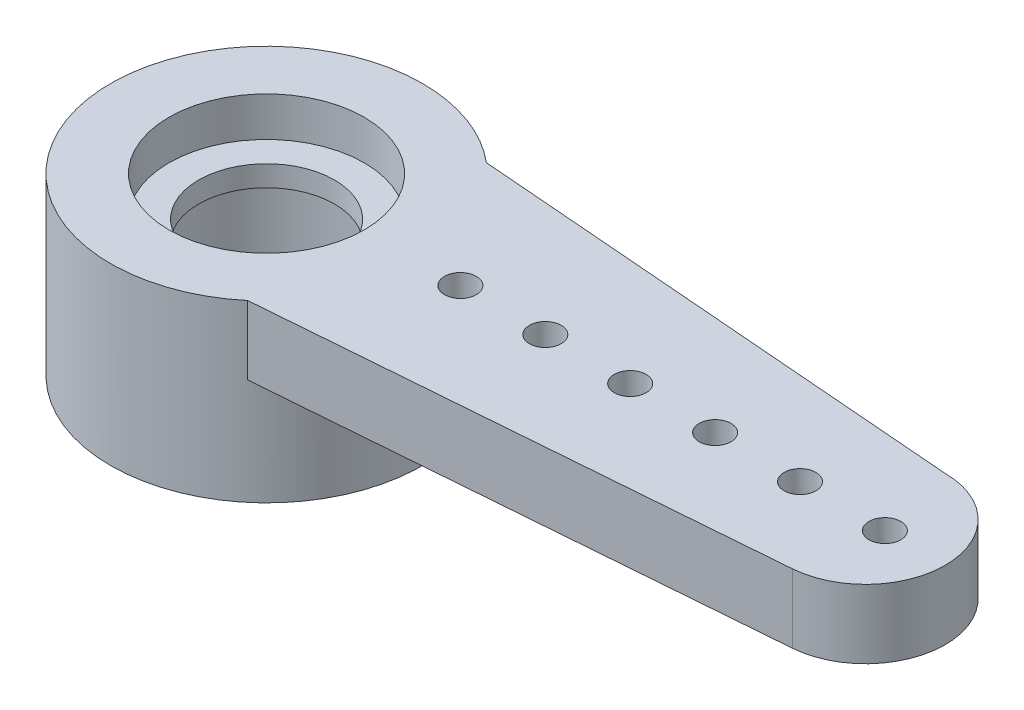
ISO-10303-21;
HEADER;
FILE_DESCRIPTION(('STEP AP214'),'2;1');
FILE_NAME('part.step','',(''),(''),'','','');
FILE_SCHEMA(('AUTOMOTIVE_DESIGN { 1 0 10303 214 1 1 1 1 }'));
ENDSEC;
DATA;
#1=APPLICATION_CONTEXT('core data for automotive mechanical design processes');
#2=APPLICATION_PROTOCOL_DEFINITION('international standard','automotive_design',2000,#1);
#3=PRODUCT_CONTEXT('',#1,'mechanical');
#4=PRODUCT('Part','Part','',(#3));
#5=PRODUCT_RELATED_PRODUCT_CATEGORY('part','',(#4));
#6=PRODUCT_DEFINITION_FORMATION('','',#4);
#7=PRODUCT_DEFINITION_CONTEXT('part definition',#1,'design');
#8=PRODUCT_DEFINITION('design','',#6,#7);
#9=PRODUCT_DEFINITION_SHAPE('','',#8);
#10=(LENGTH_UNIT() NAMED_UNIT(*) SI_UNIT(.MILLI.,.METRE.));
#11=(NAMED_UNIT(*) PLANE_ANGLE_UNIT() SI_UNIT($,.RADIAN.));
#12=(NAMED_UNIT(*) SI_UNIT($,.STERADIAN.) SOLID_ANGLE_UNIT());
#13=UNCERTAINTY_MEASURE_WITH_UNIT(LENGTH_MEASURE(1.E-05),#10,'distance_accuracy_value','');
#14=(GEOMETRIC_REPRESENTATION_CONTEXT(3) GLOBAL_UNCERTAINTY_ASSIGNED_CONTEXT((#13)) GLOBAL_UNIT_ASSIGNED_CONTEXT((#10,
#11,#12)) REPRESENTATION_CONTEXT('',''));
#15=CARTESIAN_POINT('',(0.,0.,0.));
#16=DIRECTION('',(0.,0.,1.));
#17=DIRECTION('',(1.,0.,0.));
#18=AXIS2_PLACEMENT_3D('',#15,#16,#17);
#19=CARTESIAN_POINT('',(-32.4125946346762,6.1454833995939,-10.0097718724736));
#20=DIRECTION('',(0.,-1.,0.));
#21=DIRECTION('',(0.,0.,-1.));
#22=AXIS2_PLACEMENT_3D('',#19,#20,#21);
#23=CYLINDRICAL_SURFACE('',#22,1.6);
#24=CARTESIAN_POINT('',(-32.4125946346762,0.200000000000001,-10.0097718724736));
#25=DIRECTION('',(0.,-1.,0.));
#26=DIRECTION('',(0.,0.,-1.));
#27=AXIS2_PLACEMENT_3D('',#24,#25,#26);
#28=CIRCLE('',#27,1.6);
#29=CARTESIAN_POINT('',(-32.4125946346762,0.200000000000001,-11.6097718724735));
#30=VERTEX_POINT('',#29);
#31=EDGE_CURVE('E199',#30,#30,#28,.T.);
#32=ORIENTED_EDGE('',*,*,#31,.T.);
#33=EDGE_LOOP('',(#32));
#34=FACE_BOUND('',#33,.T.);
#35=CARTESIAN_POINT('',(-32.4125946346762,0.69,-10.0097718724736));
#36=DIRECTION('',(0.,1.,0.));
#37=DIRECTION('',(0.,0.,1.));
#38=AXIS2_PLACEMENT_3D('',#35,#36,#37);
#39=CIRCLE('',#38,1.6);
#40=CARTESIAN_POINT('',(-32.4125946346762,0.69,-8.40977187247356));
#41=VERTEX_POINT('',#40);
#42=EDGE_CURVE('E37',#41,#41,#39,.F.);
#43=ORIENTED_EDGE('',*,*,#42,.F.);
#44=EDGE_LOOP('',(#43));
#45=FACE_BOUND('',#44,.T.);
#46=ADVANCED_FACE('F33',(#34,#45),#23,.F.);
#47=CARTESIAN_POINT('',(-32.4125946346762,0.,-10.0097718724736));
#48=DIRECTION('',(0.,1.,0.));
#49=DIRECTION('',(0.,0.,1.));
#50=AXIS2_PLACEMENT_3D('',#47,#48,#49);
#51=PLANE('',#50);
#52=CARTESIAN_POINT('',(-17.8462780893284,0.,-10.0089973818618));
#53=DIRECTION('',(0.,-1.,0.));
#54=DIRECTION('',(0.,0.,-1.));
#55=AXIS2_PLACEMENT_3D('',#52,#53,#54);
#56=CIRCLE('',#55,0.374999999999999);
#57=CARTESIAN_POINT('',(-17.8462780893284,0.,-10.3839973818618));
#58=VERTEX_POINT('',#57);
#59=EDGE_CURVE('E339',#58,#58,#56,.T.);
#60=ORIENTED_EDGE('',*,*,#59,.F.);
#61=EDGE_LOOP('',(#60));
#62=FACE_BOUND('',#61,.T.);
#63=CARTESIAN_POINT('',(-19.8462780893284,0.,-10.0089973818618));
#64=DIRECTION('',(0.,-1.,0.));
#65=DIRECTION('',(0.,0.,-1.));
#66=AXIS2_PLACEMENT_3D('',#63,#64,#65);
#67=CIRCLE('',#66,0.374999999999999);
#68=CARTESIAN_POINT('',(-19.8462780893284,0.,-10.3839973818618));
#69=VERTEX_POINT('',#68);
#70=EDGE_CURVE('E340',#69,#69,#67,.T.);
#71=ORIENTED_EDGE('',*,*,#70,.F.);
#72=EDGE_LOOP('',(#71));
#73=FACE_BOUND('',#72,.T.);
#74=CARTESIAN_POINT('',(-21.8462780893284,0.,-10.0089973818618));
#75=DIRECTION('',(0.,-1.,0.));
#76=DIRECTION('',(0.,0.,-1.));
#77=AXIS2_PLACEMENT_3D('',#74,#75,#76);
#78=CIRCLE('',#77,0.374999999999999);
#79=CARTESIAN_POINT('',(-21.8462780893284,0.,-10.3839973818618));
#80=VERTEX_POINT('',#79);
#81=EDGE_CURVE('E347',#80,#80,#78,.T.);
#82=ORIENTED_EDGE('',*,*,#81,.F.);
#83=EDGE_LOOP('',(#82));
#84=FACE_BOUND('',#83,.T.);
#85=CARTESIAN_POINT('',(-23.8462780893284,0.,-10.0089973818618));
#86=DIRECTION('',(0.,-1.,0.));
#87=DIRECTION('',(0.,0.,-1.));
#88=AXIS2_PLACEMENT_3D('',#85,#86,#87);
#89=CIRCLE('',#88,0.374999999999999);
#90=CARTESIAN_POINT('',(-23.8462780893284,0.,-10.3839973818618));
#91=VERTEX_POINT('',#90);
#92=EDGE_CURVE('E351',#91,#91,#89,.T.);
#93=ORIENTED_EDGE('',*,*,#92,.F.);
#94=EDGE_LOOP('',(#93));
#95=FACE_BOUND('',#94,.T.);
#96=CARTESIAN_POINT('',(-27.8462780893284,0.,-10.0089973818618));
#97=DIRECTION('',(0.,-1.,0.));
#98=DIRECTION('',(0.,0.,-1.));
#99=AXIS2_PLACEMENT_3D('',#96,#97,#98);
#100=CIRCLE('',#99,0.374999999999999);
#101=CARTESIAN_POINT('',(-27.8462780893284,0.,-10.3839973818618));
#102=VERTEX_POINT('',#101);
#103=EDGE_CURVE('E355',#102,#102,#100,.T.);
#104=ORIENTED_EDGE('',*,*,#103,.F.);
#105=EDGE_LOOP('',(#104));
#106=FACE_BOUND('',#105,.T.);
#107=CARTESIAN_POINT('',(-25.8462780893284,0.,-10.0089973818618));
#108=DIRECTION('',(0.,-1.,0.));
#109=DIRECTION('',(0.,0.,-1.));
#110=AXIS2_PLACEMENT_3D('',#107,#108,#109);
#111=CIRCLE('',#110,0.374999999999999);
#112=CARTESIAN_POINT('',(-25.8462780893284,0.,-10.3839973818618));
#113=VERTEX_POINT('',#112);
#114=EDGE_CURVE('E196',#113,#113,#111,.T.);
#115=ORIENTED_EDGE('',*,*,#114,.F.);
#116=EDGE_LOOP('',(#115));
#117=FACE_BOUND('',#116,.T.);
#118=CARTESIAN_POINT('',(-32.4125946346762,0.,-10.0097718724736));
#119=DIRECTION('',(0.,-1.,0.));
#120=DIRECTION('',(0.,0.,-1.));
#121=AXIS2_PLACEMENT_3D('',#118,#119,#120);
#122=CIRCLE('',#121,3.675);
#123=CARTESIAN_POINT('',(-30.045675129903,0.,-12.8210557531807));
#124=VERTEX_POINT('',#123);
#125=CARTESIAN_POINT('',(-30.0469709782512,0.,-7.19739748129409));
#126=VERTEX_POINT('',#125);
#127=EDGE_CURVE('E83',#124,#126,#122,.T.);
#128=ORIENTED_EDGE('',*,*,#127,.F.);
#129=DIRECTION('',(-0.996836583112928,0.,-0.0794784660630979));
#130=VECTOR('',#129,1.);
#131=CARTESIAN_POINT('',(-30.045675129903,0.,-12.8210557531807));
#132=LINE('',#131,#130);
#133=CARTESIAN_POINT('',(-18.3025946346762,0.,-11.8847718723248));
#134=VERTEX_POINT('',#133);
#135=EDGE_CURVE('E86',#134,#124,#132,.T.);
#136=ORIENTED_EDGE('',*,*,#135,.F.);
#137=CARTESIAN_POINT('',(-18.3025946346762,0.,-10.0097718724736));
#138=DIRECTION('',(0.,1.,0.));
#139=DIRECTION('',(0.,0.,1.));
#140=AXIS2_PLACEMENT_3D('',#137,#138,#139);
#141=CIRCLE('',#140,1.87499999985126);
#142=CARTESIAN_POINT('',(-18.1543476098355,0.,-8.14064164184003));
#143=VERTEX_POINT('',#142);
#144=EDGE_CURVE('E73',#143,#134,#141,.T.);
#145=ORIENTED_EDGE('',*,*,#144,.F.);
#146=DIRECTION('',(0.996869455909996,0.,-0.0790650863131628));
#147=VECTOR('',#146,1.);
#148=CARTESIAN_POINT('',(-30.0469709782512,0.,-7.19739748129409));
#149=LINE('',#148,#147);
#150=EDGE_CURVE('E66',#126,#143,#149,.T.);
#151=ORIENTED_EDGE('',*,*,#150,.F.);
#152=EDGE_LOOP('',(#128,#136,#145,#151));
#153=FACE_BOUND('',#152,.T.);
#154=ADVANCED_FACE('F85',(#62,#73,#84,#95,#106,#117,#153),#51,.F.);
#155=CARTESIAN_POINT('',(-32.4125946346762,1.62,-10.0097718724736));
#156=DIRECTION('',(0.,-1.,0.));
#157=DIRECTION('',(0.,0.,-1.));
#158=AXIS2_PLACEMENT_3D('',#155,#156,#157);
#159=CYLINDRICAL_SURFACE('',#158,3.675);
#160=DIRECTION('',(0.,-1.,0.));
#161=VECTOR('',#160,1.);
#162=CARTESIAN_POINT('',(-30.045675129903,1.62,-12.8210557531807));
#163=LINE('',#162,#161);
#164=CARTESIAN_POINT('',(-30.045675129903,1.62,-12.8210557531807));
#165=VERTEX_POINT('',#164);
#166=EDGE_CURVE('E95',#165,#124,#163,.T.);
#167=ORIENTED_EDGE('',*,*,#166,.T.);
#168=ORIENTED_EDGE('',*,*,#127,.T.);
#169=DIRECTION('',(0.,-1.,0.));
#170=VECTOR('',#169,1.);
#171=CARTESIAN_POINT('',(-30.0469709782512,1.62,-7.19739748129409));
#172=LINE('',#171,#170);
#173=CARTESIAN_POINT('',(-30.0469709782512,1.62,-7.19739748129409));
#174=VERTEX_POINT('',#173);
#175=EDGE_CURVE('E11',#174,#126,#172,.T.);
#176=ORIENTED_EDGE('',*,*,#175,.F.);
#177=CARTESIAN_POINT('',(-32.4125946346762,1.62,-10.0097718724736));
#178=DIRECTION('',(0.,1.,0.));
#179=DIRECTION('',(0.,0.,1.));
#180=AXIS2_PLACEMENT_3D('',#177,#178,#179);
#181=CIRCLE('',#180,3.675);
#182=EDGE_CURVE('E98',#165,#174,#181,.T.);
#183=ORIENTED_EDGE('',*,*,#182,.F.);
#184=EDGE_LOOP('',(#167,#168,#176,#183));
#185=FACE_BOUND('',#184,.T.);
#186=CARTESIAN_POINT('',(-32.4125946346762,-2.5,-10.0097718724736));
#187=DIRECTION('',(0.,-1.,0.));
#188=DIRECTION('',(0.,0.,-1.));
#189=AXIS2_PLACEMENT_3D('',#186,#187,#188);
#190=CIRCLE('',#189,3.675);
#191=CARTESIAN_POINT('',(-32.4125946346762,-2.5,-13.6847718724736));
#192=VERTEX_POINT('',#191);
#193=EDGE_CURVE('E90',#192,#192,#190,.T.);
#194=ORIENTED_EDGE('',*,*,#193,.F.);
#195=EDGE_LOOP('',(#194));
#196=FACE_BOUND('',#195,.T.);
#197=ADVANCED_FACE('F35',(#185,#196),#159,.T.);
#198=CARTESIAN_POINT('',(-30.0469709782512,1.62,-7.19739748129409));
#199=DIRECTION('',(-0.0790650863131628,0.,-0.996869455909996));
#200=DIRECTION('',(-0.996869455909996,0.,0.0790650863131628));
#201=AXIS2_PLACEMENT_3D('',#198,#199,#200);
#202=PLANE('',#201);
#203=ORIENTED_EDGE('',*,*,#150,.T.);
#204=DIRECTION('',(0.,-1.,0.));
#205=VECTOR('',#204,1.);
#206=CARTESIAN_POINT('',(-18.1543476098355,1.62,-8.14064164184003));
#207=LINE('',#206,#205);
#208=CARTESIAN_POINT('',(-18.1543476098355,1.62,-8.14064164184003));
#209=VERTEX_POINT('',#208);
#210=EDGE_CURVE('E43',#209,#143,#207,.T.);
#211=ORIENTED_EDGE('',*,*,#210,.F.);
#212=DIRECTION('',(0.996869455909996,0.,-0.0790650863131628));
#213=VECTOR('',#212,1.);
#214=CARTESIAN_POINT('',(-30.0469709782512,1.62,-7.19739748129409));
#215=LINE('',#214,#213);
#216=EDGE_CURVE('E78',#174,#209,#215,.T.);
#217=ORIENTED_EDGE('',*,*,#216,.F.);
#218=ORIENTED_EDGE('',*,*,#175,.T.);
#219=EDGE_LOOP('',(#203,#211,#217,#218));
#220=FACE_BOUND('',#219,.T.);
#221=ADVANCED_FACE('F126',(#220),#202,.F.);
#222=CARTESIAN_POINT('',(-18.3025946346762,1.62,-10.0097718724736));
#223=DIRECTION('',(0.,-1.,0.));
#224=DIRECTION('',(0.,0.,-1.));
#225=AXIS2_PLACEMENT_3D('',#222,#223,#224);
#226=CYLINDRICAL_SURFACE('',#225,1.87499999985126);
#227=ORIENTED_EDGE('',*,*,#144,.T.);
#228=DIRECTION('',(0.,-1.,0.));
#229=VECTOR('',#228,1.);
#230=CARTESIAN_POINT('',(-18.3025946346762,1.62,-11.8847718723248));
#231=LINE('',#230,#229);
#232=CARTESIAN_POINT('',(-18.3025946346762,1.62,-11.8847718723248));
#233=VERTEX_POINT('',#232);
#234=EDGE_CURVE('E97',#233,#134,#231,.T.);
#235=ORIENTED_EDGE('',*,*,#234,.F.);
#236=CARTESIAN_POINT('',(-18.3025946346762,1.62,-10.0097718724736));
#237=DIRECTION('',(0.,1.,0.));
#238=DIRECTION('',(0.,0.,1.));
#239=AXIS2_PLACEMENT_3D('',#236,#237,#238);
#240=CIRCLE('',#239,1.87499999985126);
#241=EDGE_CURVE('E103',#209,#233,#240,.T.);
#242=ORIENTED_EDGE('',*,*,#241,.F.);
#243=ORIENTED_EDGE('',*,*,#210,.T.);
#244=EDGE_LOOP('',(#227,#235,#242,#243));
#245=FACE_BOUND('',#244,.T.);
#246=ADVANCED_FACE('F124',(#245),#226,.T.);
#247=CARTESIAN_POINT('',(-30.045675129903,1.62,-12.8210557531807));
#248=DIRECTION('',(-0.0794784660630979,0.,0.996836583112928));
#249=DIRECTION('',(0.996836583112928,0.,0.0794784660630979));
#250=AXIS2_PLACEMENT_3D('',#247,#248,#249);
#251=PLANE('',#250);
#252=ORIENTED_EDGE('',*,*,#135,.T.);
#253=ORIENTED_EDGE('',*,*,#166,.F.);
#254=DIRECTION('',(-0.996836583112928,0.,-0.0794784660630979));
#255=VECTOR('',#254,1.);
#256=CARTESIAN_POINT('',(-30.045675129903,1.62,-12.8210557531807));
#257=LINE('',#256,#255);
#258=EDGE_CURVE('E52',#233,#165,#257,.T.);
#259=ORIENTED_EDGE('',*,*,#258,.F.);
#260=ORIENTED_EDGE('',*,*,#234,.T.);
#261=EDGE_LOOP('',(#252,#253,#259,#260));
#262=FACE_BOUND('',#261,.T.);
#263=ADVANCED_FACE('F94',(#262),#251,.F.);
#264=CARTESIAN_POINT('',(-32.4125946346762,1.62,-10.0097718724736));
#265=DIRECTION('',(0.,1.,0.));
#266=DIRECTION('',(0.,0.,1.));
#267=AXIS2_PLACEMENT_3D('',#264,#265,#266);
#268=PLANE('',#267);
#269=CARTESIAN_POINT('',(-17.8462780893284,1.62,-10.0089973818618));
#270=DIRECTION('',(0.,1.,0.));
#271=DIRECTION('',(0.,0.,1.));
#272=AXIS2_PLACEMENT_3D('',#269,#270,#271);
#273=CIRCLE('',#272,0.374999999999999);
#274=CARTESIAN_POINT('',(-17.8462780893284,1.62,-9.63399738186179));
#275=VERTEX_POINT('',#274);
#276=EDGE_CURVE('E167',#275,#275,#273,.F.);
#277=ORIENTED_EDGE('',*,*,#276,.T.);
#278=EDGE_LOOP('',(#277));
#279=FACE_BOUND('',#278,.T.);
#280=CARTESIAN_POINT('',(-19.8462780893284,1.62,-10.0089973818618));
#281=DIRECTION('',(0.,1.,0.));
#282=DIRECTION('',(0.,0.,1.));
#283=AXIS2_PLACEMENT_3D('',#280,#281,#282);
#284=CIRCLE('',#283,0.374999999999999);
#285=CARTESIAN_POINT('',(-19.8462780893284,1.62,-9.63399738186179));
#286=VERTEX_POINT('',#285);
#287=EDGE_CURVE('E171',#286,#286,#284,.F.);
#288=ORIENTED_EDGE('',*,*,#287,.T.);
#289=EDGE_LOOP('',(#288));
#290=FACE_BOUND('',#289,.T.);
#291=CARTESIAN_POINT('',(-21.8462780893284,1.62,-10.0089973818618));
#292=DIRECTION('',(0.,1.,0.));
#293=DIRECTION('',(0.,0.,1.));
#294=AXIS2_PLACEMENT_3D('',#291,#292,#293);
#295=CIRCLE('',#294,0.374999999999999);
#296=CARTESIAN_POINT('',(-21.8462780893284,1.62,-9.63399738186179));
#297=VERTEX_POINT('',#296);
#298=EDGE_CURVE('E175',#297,#297,#295,.F.);
#299=ORIENTED_EDGE('',*,*,#298,.T.);
#300=EDGE_LOOP('',(#299));
#301=FACE_BOUND('',#300,.T.);
#302=CARTESIAN_POINT('',(-23.8462780893284,1.62,-10.0089973818618));
#303=DIRECTION('',(0.,1.,0.));
#304=DIRECTION('',(0.,0.,1.));
#305=AXIS2_PLACEMENT_3D('',#302,#303,#304);
#306=CIRCLE('',#305,0.374999999999999);
#307=CARTESIAN_POINT('',(-23.8462780893284,1.62,-9.63399738186179));
#308=VERTEX_POINT('',#307);
#309=EDGE_CURVE('E179',#308,#308,#306,.F.);
#310=ORIENTED_EDGE('',*,*,#309,.T.);
#311=EDGE_LOOP('',(#310));
#312=FACE_BOUND('',#311,.T.);
#313=CARTESIAN_POINT('',(-27.8462780893284,1.62,-10.0089973818618));
#314=DIRECTION('',(0.,1.,0.));
#315=DIRECTION('',(0.,0.,1.));
#316=AXIS2_PLACEMENT_3D('',#313,#314,#315);
#317=CIRCLE('',#316,0.374999999999999);
#318=CARTESIAN_POINT('',(-27.8462780893284,1.62,-9.63399738186179));
#319=VERTEX_POINT('',#318);
#320=EDGE_CURVE('E183',#319,#319,#317,.F.);
#321=ORIENTED_EDGE('',*,*,#320,.T.);
#322=EDGE_LOOP('',(#321));
#323=FACE_BOUND('',#322,.T.);
#324=CARTESIAN_POINT('',(-25.8462780893284,1.62,-10.0089973818618));
#325=DIRECTION('',(0.,1.,0.));
#326=DIRECTION('',(0.,0.,1.));
#327=AXIS2_PLACEMENT_3D('',#324,#325,#326);
#328=CIRCLE('',#327,0.374999999999999);
#329=CARTESIAN_POINT('',(-25.8462780893284,1.62,-9.63399738186179));
#330=VERTEX_POINT('',#329);
#331=EDGE_CURVE('E187',#330,#330,#328,.F.);
#332=ORIENTED_EDGE('',*,*,#331,.T.);
#333=EDGE_LOOP('',(#332));
#334=FACE_BOUND('',#333,.T.);
#335=CARTESIAN_POINT('',(-32.4125946346762,1.62,-10.0097718724736));
#336=DIRECTION('',(0.,1.,0.));
#337=DIRECTION('',(0.,0.,1.));
#338=AXIS2_PLACEMENT_3D('',#335,#336,#337);
#339=CIRCLE('',#338,2.3);
#340=CARTESIAN_POINT('',(-32.4125946346762,1.62,-7.70977187247356));
#341=VERTEX_POINT('',#340);
#342=EDGE_CURVE('E190',#341,#341,#339,.T.);
#343=ORIENTED_EDGE('',*,*,#342,.F.);
#344=EDGE_LOOP('',(#343));
#345=FACE_BOUND('',#344,.T.);
#346=ORIENTED_EDGE('',*,*,#182,.T.);
#347=ORIENTED_EDGE('',*,*,#216,.T.);
#348=ORIENTED_EDGE('',*,*,#241,.T.);
#349=ORIENTED_EDGE('',*,*,#258,.T.);
#350=EDGE_LOOP('',(#346,#347,#348,#349));
#351=FACE_BOUND('',#350,.T.);
#352=ADVANCED_FACE('F123',(#279,#290,#301,#312,#323,#334,#345,#351),#268,.T.);
#353=CARTESIAN_POINT('',(-32.4125946346762,-2.5,-10.0097718724736));
#354=DIRECTION('',(0.,-1.,0.));
#355=DIRECTION('',(0.,0.,-1.));
#356=AXIS2_PLACEMENT_3D('',#353,#354,#355);
#357=PLANE('',#356);
#358=CARTESIAN_POINT('',(-32.4125946346762,-2.5,-10.0097718724736));
#359=DIRECTION('',(0.,-1.,0.));
#360=DIRECTION('',(0.,0.,-1.));
#361=AXIS2_PLACEMENT_3D('',#358,#359,#360);
#362=CIRCLE('',#361,2.3);
#363=CARTESIAN_POINT('',(-32.4125946346762,-2.5,-12.3097718724736));
#364=VERTEX_POINT('',#363);
#365=EDGE_CURVE('E201',#364,#364,#362,.T.);
#366=ORIENTED_EDGE('',*,*,#365,.F.);
#367=EDGE_LOOP('',(#366));
#368=FACE_BOUND('',#367,.T.);
#369=ORIENTED_EDGE('',*,*,#193,.T.);
#370=EDGE_LOOP('',(#369));
#371=FACE_BOUND('',#370,.T.);
#372=ADVANCED_FACE('F155',(#368,#371),#357,.T.);
#373=CARTESIAN_POINT('',(-32.4125946346762,0.2,-10.0097718724736));
#374=DIRECTION('',(0.,-1.,0.));
#375=DIRECTION('',(0.,0.,-1.));
#376=AXIS2_PLACEMENT_3D('',#373,#374,#375);
#377=CYLINDRICAL_SURFACE('',#376,2.3);
#378=CARTESIAN_POINT('',(-32.4125946346762,0.2,-10.0097718724736));
#379=DIRECTION('',(0.,-1.,0.));
#380=DIRECTION('',(0.,0.,-1.));
#381=AXIS2_PLACEMENT_3D('',#378,#379,#380);
#382=CIRCLE('',#381,2.3);
#383=CARTESIAN_POINT('',(-32.4125946346762,0.2,-12.3097718724736));
#384=VERTEX_POINT('',#383);
#385=EDGE_CURVE('E91',#384,#384,#382,.T.);
#386=ORIENTED_EDGE('',*,*,#385,.F.);
#387=EDGE_LOOP('',(#386));
#388=FACE_BOUND('',#387,.T.);
#389=ORIENTED_EDGE('',*,*,#365,.T.);
#390=EDGE_LOOP('',(#389));
#391=FACE_BOUND('',#390,.T.);
#392=ADVANCED_FACE('F151',(#388,#391),#377,.F.);
#393=CARTESIAN_POINT('',(-32.4125946346762,0.2,-10.0097718724736));
#394=DIRECTION('',(0.,-1.,0.));
#395=DIRECTION('',(0.,0.,-1.));
#396=AXIS2_PLACEMENT_3D('',#393,#394,#395);
#397=PLANE('',#396);
#398=ORIENTED_EDGE('',*,*,#31,.F.);
#399=EDGE_LOOP('',(#398));
#400=FACE_BOUND('',#399,.T.);
#401=ORIENTED_EDGE('',*,*,#385,.T.);
#402=EDGE_LOOP('',(#401));
#403=FACE_BOUND('',#402,.T.);
#404=ADVANCED_FACE('F147',(#400,#403),#397,.T.);
#405=CARTESIAN_POINT('',(-32.4125946346762,0.69,-10.0097718724736));
#406=DIRECTION('',(0.,1.,0.));
#407=DIRECTION('',(0.,0.,1.));
#408=AXIS2_PLACEMENT_3D('',#405,#406,#407);
#409=PLANE('',#408);
#410=CARTESIAN_POINT('',(-32.4125946346762,0.69,-10.0097718724736));
#411=DIRECTION('',(0.,1.,0.));
#412=DIRECTION('',(0.,0.,1.));
#413=AXIS2_PLACEMENT_3D('',#410,#411,#412);
#414=CIRCLE('',#413,2.3);
#415=CARTESIAN_POINT('',(-32.4125946346762,0.69,-7.70977187247356));
#416=VERTEX_POINT('',#415);
#417=EDGE_CURVE('E192',#416,#416,#414,.T.);
#418=ORIENTED_EDGE('',*,*,#417,.T.);
#419=EDGE_LOOP('',(#418));
#420=FACE_BOUND('',#419,.T.);
#421=ORIENTED_EDGE('',*,*,#42,.T.);
#422=EDGE_LOOP('',(#421));
#423=FACE_BOUND('',#422,.T.);
#424=ADVANCED_FACE('F150',(#420,#423),#409,.T.);
#425=CARTESIAN_POINT('',(-32.4125946346762,0.69,-10.0097718724736));
#426=DIRECTION('',(0.,1.,0.));
#427=DIRECTION('',(0.,0.,1.));
#428=AXIS2_PLACEMENT_3D('',#425,#426,#427);
#429=CYLINDRICAL_SURFACE('',#428,2.3);
#430=ORIENTED_EDGE('',*,*,#417,.F.);
#431=EDGE_LOOP('',(#430));
#432=FACE_BOUND('',#431,.T.);
#433=ORIENTED_EDGE('',*,*,#342,.T.);
#434=EDGE_LOOP('',(#433));
#435=FACE_BOUND('',#434,.T.);
#436=ADVANCED_FACE('F145',(#432,#435),#429,.F.);
#437=CARTESIAN_POINT('',(-25.8462780893284,2.68066017177982,-10.0089973818618));
#438=DIRECTION('',(0.,-1.,0.));
#439=DIRECTION('',(0.,0.,-1.));
#440=AXIS2_PLACEMENT_3D('',#437,#438,#439);
#441=CYLINDRICAL_SURFACE('',#440,0.374999999999999);
#442=ORIENTED_EDGE('',*,*,#114,.T.);
#443=EDGE_LOOP('',(#442));
#444=FACE_BOUND('',#443,.T.);
#445=ORIENTED_EDGE('',*,*,#331,.F.);
#446=EDGE_LOOP('',(#445));
#447=FACE_BOUND('',#446,.T.);
#448=ADVANCED_FACE('F265',(#444,#447),#441,.F.);
#449=CARTESIAN_POINT('',(-27.8462780893284,2.68066017177982,-10.0089973818618));
#450=DIRECTION('',(0.,-1.,0.));
#451=DIRECTION('',(0.,0.,-1.));
#452=AXIS2_PLACEMENT_3D('',#449,#450,#451);
#453=CYLINDRICAL_SURFACE('',#452,0.374999999999999);
#454=ORIENTED_EDGE('',*,*,#103,.T.);
#455=EDGE_LOOP('',(#454));
#456=FACE_BOUND('',#455,.T.);
#457=ORIENTED_EDGE('',*,*,#320,.F.);
#458=EDGE_LOOP('',(#457));
#459=FACE_BOUND('',#458,.T.);
#460=ADVANCED_FACE('F282',(#456,#459),#453,.F.);
#461=CARTESIAN_POINT('',(-23.8462780893284,2.68066017177982,-10.0089973818618));
#462=DIRECTION('',(0.,-1.,0.));
#463=DIRECTION('',(0.,0.,-1.));
#464=AXIS2_PLACEMENT_3D('',#461,#462,#463);
#465=CYLINDRICAL_SURFACE('',#464,0.374999999999999);
#466=ORIENTED_EDGE('',*,*,#92,.T.);
#467=EDGE_LOOP('',(#466));
#468=FACE_BOUND('',#467,.T.);
#469=ORIENTED_EDGE('',*,*,#309,.F.);
#470=EDGE_LOOP('',(#469));
#471=FACE_BOUND('',#470,.T.);
#472=ADVANCED_FACE('F292',(#468,#471),#465,.F.);
#473=CARTESIAN_POINT('',(-21.8462780893284,2.68066017177982,-10.0089973818618));
#474=DIRECTION('',(0.,-1.,0.));
#475=DIRECTION('',(0.,0.,-1.));
#476=AXIS2_PLACEMENT_3D('',#473,#474,#475);
#477=CYLINDRICAL_SURFACE('',#476,0.374999999999999);
#478=ORIENTED_EDGE('',*,*,#81,.T.);
#479=EDGE_LOOP('',(#478));
#480=FACE_BOUND('',#479,.T.);
#481=ORIENTED_EDGE('',*,*,#298,.F.);
#482=EDGE_LOOP('',(#481));
#483=FACE_BOUND('',#482,.T.);
#484=ADVANCED_FACE('F302',(#480,#483),#477,.F.);
#485=CARTESIAN_POINT('',(-19.8462780893284,2.68066017177982,-10.0089973818618));
#486=DIRECTION('',(0.,-1.,0.));
#487=DIRECTION('',(0.,0.,-1.));
#488=AXIS2_PLACEMENT_3D('',#485,#486,#487);
#489=CYLINDRICAL_SURFACE('',#488,0.374999999999999);
#490=ORIENTED_EDGE('',*,*,#70,.T.);
#491=EDGE_LOOP('',(#490));
#492=FACE_BOUND('',#491,.T.);
#493=ORIENTED_EDGE('',*,*,#287,.F.);
#494=EDGE_LOOP('',(#493));
#495=FACE_BOUND('',#494,.T.);
#496=ADVANCED_FACE('F312',(#492,#495),#489,.F.);
#497=CARTESIAN_POINT('',(-17.8462780893284,2.68066017177982,-10.0089973818618));
#498=DIRECTION('',(0.,-1.,0.));
#499=DIRECTION('',(0.,0.,-1.));
#500=AXIS2_PLACEMENT_3D('',#497,#498,#499);
#501=CYLINDRICAL_SURFACE('',#500,0.374999999999999);
#502=ORIENTED_EDGE('',*,*,#59,.T.);
#503=EDGE_LOOP('',(#502));
#504=FACE_BOUND('',#503,.T.);
#505=ORIENTED_EDGE('',*,*,#276,.F.);
#506=EDGE_LOOP('',(#505));
#507=FACE_BOUND('',#506,.T.);
#508=ADVANCED_FACE('F322',(#504,#507),#501,.F.);
#509=CLOSED_SHELL('',(#46,#154,#197,#221,#246,#263,#352,#372,#392,#404,#424,#436,#448,#460,#472,
#484,#496,#508));
#510=MANIFOLD_SOLID_BREP('B2',#509);
#511=ADVANCED_BREP_SHAPE_REPRESENTATION('',(#18,#510),#14);
#512=SHAPE_DEFINITION_REPRESENTATION(#9,#511);
ENDSEC;
END-ISO-10303-21;
